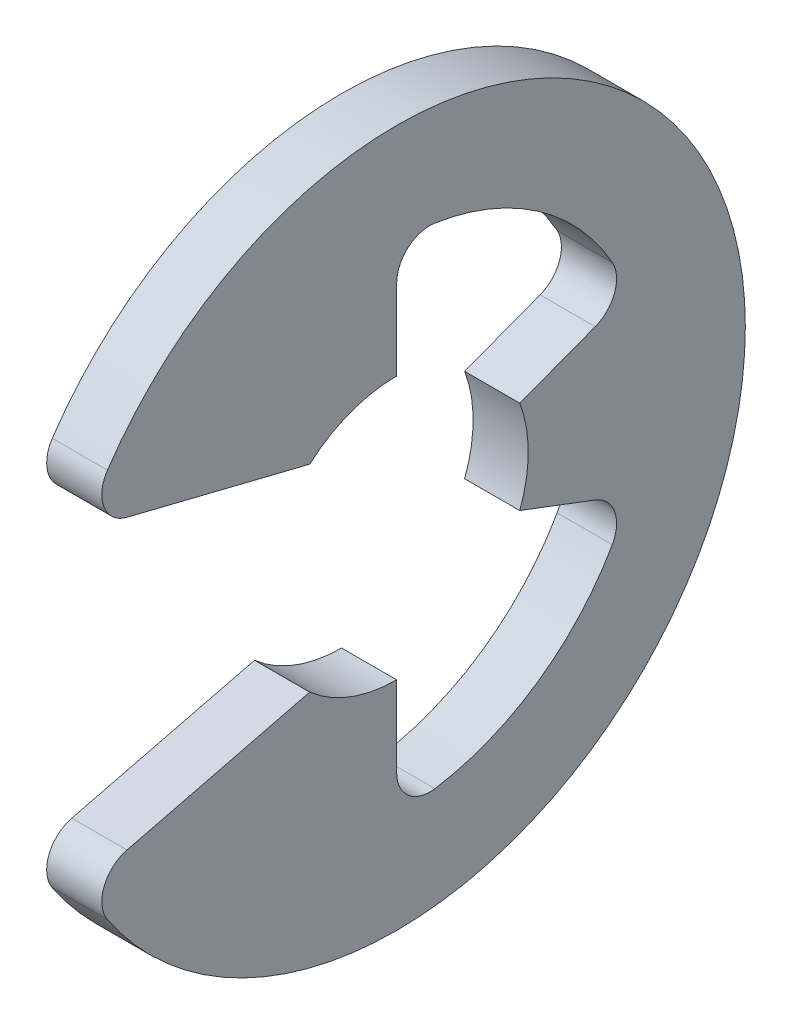
ISO-10303-21;
HEADER;
FILE_DESCRIPTION(('STEP AP214'),'2;1');
FILE_NAME('part.step','',(''),(''),'','','');
FILE_SCHEMA(('AUTOMOTIVE_DESIGN { 1 0 10303 214 1 1 1 1 }'));
ENDSEC;
DATA;
#1=APPLICATION_CONTEXT('core data for automotive mechanical design processes');
#2=APPLICATION_PROTOCOL_DEFINITION('international standard','automotive_design',2000,#1);
#3=PRODUCT_CONTEXT('',#1,'mechanical');
#4=PRODUCT('Part','Part','',(#3));
#5=PRODUCT_RELATED_PRODUCT_CATEGORY('part','',(#4));
#6=PRODUCT_DEFINITION_FORMATION('','',#4);
#7=PRODUCT_DEFINITION_CONTEXT('part definition',#1,'design');
#8=PRODUCT_DEFINITION('design','',#6,#7);
#9=PRODUCT_DEFINITION_SHAPE('','',#8);
#10=(LENGTH_UNIT() NAMED_UNIT(*) SI_UNIT(.MILLI.,.METRE.));
#11=(NAMED_UNIT(*) PLANE_ANGLE_UNIT() SI_UNIT($,.RADIAN.));
#12=(NAMED_UNIT(*) SI_UNIT($,.STERADIAN.) SOLID_ANGLE_UNIT());
#13=UNCERTAINTY_MEASURE_WITH_UNIT(LENGTH_MEASURE(1.E-05),#10,'distance_accuracy_value','');
#14=(GEOMETRIC_REPRESENTATION_CONTEXT(3) GLOBAL_UNCERTAINTY_ASSIGNED_CONTEXT((#13)) GLOBAL_UNIT_ASSIGNED_CONTEXT((#10,
#11,#12)) REPRESENTATION_CONTEXT('',''));
#15=CARTESIAN_POINT('',(0.,0.,0.));
#16=DIRECTION('',(0.,0.,1.));
#17=DIRECTION('',(1.,0.,0.));
#18=AXIS2_PLACEMENT_3D('',#15,#16,#17);
#19=CARTESIAN_POINT('',(-0.35,0.,0.));
#20=DIRECTION('',(1.,0.,0.));
#21=DIRECTION('',(0.,0.,-1.));
#22=AXIS2_PLACEMENT_3D('',#19,#20,#21);
#23=CYLINDRICAL_SURFACE('',#22,1.67);
#24=CARTESIAN_POINT('',(0.35,0.,0.));
#25=DIRECTION('',(-1.,0.,0.));
#26=DIRECTION('',(0.,0.,1.));
#27=AXIS2_PLACEMENT_3D('',#24,#25,#26);
#28=CIRCLE('',#27,1.67);
#29=CARTESIAN_POINT('',(0.35,-1.67,0.));
#30=VERTEX_POINT('',#29);
#31=CARTESIAN_POINT('',(0.35,-1.2525,1.10460117236947));
#32=VERTEX_POINT('',#31);
#33=EDGE_CURVE('E190',#30,#32,#28,.T.);
#34=ORIENTED_EDGE('',*,*,#33,.F.);
#35=DIRECTION('',(1.,0.,0.));
#36=VECTOR('',#35,1.);
#37=CARTESIAN_POINT('',(-0.35,-1.67,0.));
#38=LINE('',#37,#36);
#39=CARTESIAN_POINT('',(-0.35,-1.67,0.));
#40=VERTEX_POINT('',#39);
#41=EDGE_CURVE('E11',#40,#30,#38,.T.);
#42=ORIENTED_EDGE('',*,*,#41,.F.);
#43=CARTESIAN_POINT('',(-0.35,0.,0.));
#44=DIRECTION('',(-1.,0.,0.));
#45=DIRECTION('',(0.,0.,1.));
#46=AXIS2_PLACEMENT_3D('',#43,#44,#45);
#47=CIRCLE('',#46,1.67);
#48=CARTESIAN_POINT('',(-0.35,-1.2525,1.10460117236947));
#49=VERTEX_POINT('',#48);
#50=EDGE_CURVE('E240',#40,#49,#47,.T.);
#51=ORIENTED_EDGE('',*,*,#50,.T.);
#52=DIRECTION('',(1.,0.,0.));
#53=VECTOR('',#52,1.);
#54=CARTESIAN_POINT('',(-0.35,-1.2525,1.10460117236947));
#55=LINE('',#54,#53);
#56=EDGE_CURVE('E36',#49,#32,#55,.T.);
#57=ORIENTED_EDGE('',*,*,#56,.T.);
#58=EDGE_LOOP('',(#34,#42,#51,#57));
#59=FACE_BOUND('',#58,.T.);
#60=ADVANCED_FACE('F33',(#59),#23,.F.);
#61=CARTESIAN_POINT('',(-0.35,-2.693254687494,0.));
#62=DIRECTION('',(0.,0.,-1.));
#63=DIRECTION('',(0.,1.,0.));
#64=AXIS2_PLACEMENT_3D('',#61,#62,#63);
#65=PLANE('',#64);
#66=DIRECTION('',(0.,1.,0.));
#67=VECTOR('',#66,1.);
#68=CARTESIAN_POINT('',(0.35,-2.693254687494,0.));
#69=LINE('',#68,#67);
#70=CARTESIAN_POINT('',(0.35,-2.693254687494,0.));
#71=VERTEX_POINT('',#70);
#72=EDGE_CURVE('E238',#71,#30,#69,.T.);
#73=ORIENTED_EDGE('',*,*,#72,.F.);
#74=DIRECTION('',(1.,0.,0.));
#75=VECTOR('',#74,1.);
#76=CARTESIAN_POINT('',(-0.35,-2.693254687494,0.));
#77=LINE('',#76,#75);
#78=CARTESIAN_POINT('',(-0.35,-2.693254687494,0.));
#79=VERTEX_POINT('',#78);
#80=EDGE_CURVE('E42',#79,#71,#77,.T.);
#81=ORIENTED_EDGE('',*,*,#80,.F.);
#82=DIRECTION('',(0.,1.,0.));
#83=VECTOR('',#82,1.);
#84=CARTESIAN_POINT('',(-0.35,-2.693254687494,0.));
#85=LINE('',#84,#83);
#86=EDGE_CURVE('E180',#79,#40,#85,.T.);
#87=ORIENTED_EDGE('',*,*,#86,.T.);
#88=ORIENTED_EDGE('',*,*,#41,.T.);
#89=EDGE_LOOP('',(#73,#81,#87,#88));
#90=FACE_BOUND('',#89,.T.);
#91=ADVANCED_FACE('F272',(#90),#65,.T.);
#92=CARTESIAN_POINT('',(-0.35,-2.693254687494,-0.419999999999289));
#93=DIRECTION('',(1.,0.,0.));
#94=DIRECTION('',(0.,0.,-1.));
#95=AXIS2_PLACEMENT_3D('',#92,#93,#94);
#96=CYLINDRICAL_SURFACE('',#95,0.41999999999929);
#97=CARTESIAN_POINT('',(0.35,-2.693254687494,-0.419999999999289));
#98=DIRECTION('',(-1.,0.,0.));
#99=DIRECTION('',(0.,0.,1.));
#100=AXIS2_PLACEMENT_3D('',#97,#98,#99);
#101=CIRCLE('',#100,0.41999999999929);
#102=CARTESIAN_POINT('',(0.35,-3.10823901922165,-0.484714792898247));
#103=VERTEX_POINT('',#102);
#104=EDGE_CURVE('E167',#103,#71,#101,.T.);
#105=ORIENTED_EDGE('',*,*,#104,.F.);
#106=DIRECTION('',(1.,0.,0.));
#107=VECTOR('',#106,1.);
#108=CARTESIAN_POINT('',(-0.35,-3.10823901922165,-0.484714792898247));
#109=LINE('',#108,#107);
#110=CARTESIAN_POINT('',(-0.35,-3.10823901922165,-0.484714792898247));
#111=VERTEX_POINT('',#110);
#112=EDGE_CURVE('E162',#111,#103,#109,.T.);
#113=ORIENTED_EDGE('',*,*,#112,.F.);
#114=CARTESIAN_POINT('',(-0.35,-2.693254687494,-0.419999999999289));
#115=DIRECTION('',(-1.,0.,0.));
#116=DIRECTION('',(0.,0.,1.));
#117=AXIS2_PLACEMENT_3D('',#114,#115,#116);
#118=CIRCLE('',#117,0.41999999999929);
#119=EDGE_CURVE('E165',#111,#79,#118,.T.);
#120=ORIENTED_EDGE('',*,*,#119,.T.);
#121=ORIENTED_EDGE('',*,*,#80,.T.);
#122=EDGE_LOOP('',(#105,#113,#120,#121));
#123=FACE_BOUND('',#122,.T.);
#124=ADVANCED_FACE('F164',(#123),#96,.F.);
#125=CARTESIAN_POINT('',(-0.35,0.,0.));
#126=DIRECTION('',(1.,0.,0.));
#127=DIRECTION('',(0.,0.,-1.));
#128=AXIS2_PLACEMENT_3D('',#125,#126,#127);
#129=CYLINDRICAL_SURFACE('',#128,3.14580645162197);
#130=CARTESIAN_POINT('',(0.35,0.,0.));
#131=DIRECTION('',(-1.,0.,0.));
#132=DIRECTION('',(0.,0.,1.));
#133=AXIS2_PLACEMENT_3D('',#130,#131,#132);
#134=CIRCLE('',#133,3.14580645162197);
#135=CARTESIAN_POINT('',(0.35,-1.55233761535774,-2.73611881302911));
#136=VERTEX_POINT('',#135);
#137=EDGE_CURVE('E235',#136,#103,#134,.T.);
#138=ORIENTED_EDGE('',*,*,#137,.F.);
#139=DIRECTION('',(1.,0.,0.));
#140=VECTOR('',#139,1.);
#141=CARTESIAN_POINT('',(-0.35,-1.55233761535774,-2.73611881302911));
#142=LINE('',#141,#140);
#143=CARTESIAN_POINT('',(-0.35,-1.55233761535774,-2.73611881302911));
#144=VERTEX_POINT('',#143);
#145=EDGE_CURVE('E172',#144,#136,#142,.T.);
#146=ORIENTED_EDGE('',*,*,#145,.F.);
#147=CARTESIAN_POINT('',(-0.35,0.,0.));
#148=DIRECTION('',(-1.,0.,0.));
#149=DIRECTION('',(0.,0.,1.));
#150=AXIS2_PLACEMENT_3D('',#147,#148,#149);
#151=CIRCLE('',#150,3.14580645162197);
#152=EDGE_CURVE('E178',#144,#111,#151,.T.);
#153=ORIENTED_EDGE('',*,*,#152,.T.);
#154=ORIENTED_EDGE('',*,*,#112,.T.);
#155=EDGE_LOOP('',(#138,#146,#153,#154));
#156=FACE_BOUND('',#155,.T.);
#157=ADVANCED_FACE('F182',(#156),#129,.F.);
#158=CARTESIAN_POINT('',(-0.35,-1.34508335211213,-2.37081664993226));
#159=DIRECTION('',(1.,0.,0.));
#160=DIRECTION('',(0.,0.,-1.));
#161=AXIS2_PLACEMENT_3D('',#158,#159,#160);
#162=CYLINDRICAL_SURFACE('',#161,0.419999999996093);
#163=CARTESIAN_POINT('',(0.35,-1.34508335211213,-2.37081664993226));
#164=DIRECTION('',(-1.,0.,0.));
#165=DIRECTION('',(0.,0.,1.));
#166=AXIS2_PLACEMENT_3D('',#163,#164,#165);
#167=CIRCLE('',#166,0.419999999996093);
#168=CARTESIAN_POINT('',(0.35,-0.952209326505052,-2.51930907398146));
#169=VERTEX_POINT('',#168);
#170=EDGE_CURVE('E232',#169,#136,#167,.T.);
#171=ORIENTED_EDGE('',*,*,#170,.F.);
#172=DIRECTION('',(1.,0.,0.));
#173=VECTOR('',#172,1.);
#174=CARTESIAN_POINT('',(-0.35,-0.952209326505052,-2.51930907398146));
#175=LINE('',#174,#173);
#176=CARTESIAN_POINT('',(-0.35,-0.952209326505052,-2.51930907398146));
#177=VERTEX_POINT('',#176);
#178=EDGE_CURVE('E244',#177,#169,#175,.T.);
#179=ORIENTED_EDGE('',*,*,#178,.F.);
#180=CARTESIAN_POINT('',(-0.35,-1.34508335211213,-2.37081664993226));
#181=DIRECTION('',(-1.,0.,0.));
#182=DIRECTION('',(0.,0.,1.));
#183=AXIS2_PLACEMENT_3D('',#180,#181,#182);
#184=CIRCLE('',#183,0.419999999996093);
#185=EDGE_CURVE('E183',#177,#144,#184,.T.);
#186=ORIENTED_EDGE('',*,*,#185,.T.);
#187=ORIENTED_EDGE('',*,*,#145,.T.);
#188=EDGE_LOOP('',(#171,#179,#186,#187));
#189=FACE_BOUND('',#188,.T.);
#190=ADVANCED_FACE('F285',(#189),#162,.F.);
#191=CARTESIAN_POINT('',(-0.35,-0.590434162296348,-1.56214195897601));
#192=DIRECTION('',(0.,-0.935414346692222,0.353553390596615));
#193=DIRECTION('',(0.,-0.353553390596615,-0.935414346692222));
#194=AXIS2_PLACEMENT_3D('',#191,#192,#193);
#195=PLANE('',#194);
#196=DIRECTION('',(0.,-0.353553390596615,-0.935414346692222));
#197=VECTOR('',#196,1.);
#198=CARTESIAN_POINT('',(0.35,-0.590434162296348,-1.56214195897601));
#199=LINE('',#198,#197);
#200=CARTESIAN_POINT('',(0.35,-0.590434162296348,-1.56214195897601));
#201=VERTEX_POINT('',#200);
#202=EDGE_CURVE('E229',#201,#169,#199,.T.);
#203=ORIENTED_EDGE('',*,*,#202,.F.);
#204=DIRECTION('',(1.,0.,0.));
#205=VECTOR('',#204,1.);
#206=CARTESIAN_POINT('',(-0.35,-0.590434162296348,-1.56214195897601));
#207=LINE('',#206,#205);
#208=CARTESIAN_POINT('',(-0.35,-0.590434162296348,-1.56214195897601));
#209=VERTEX_POINT('',#208);
#210=EDGE_CURVE('E246',#209,#201,#207,.T.);
#211=ORIENTED_EDGE('',*,*,#210,.F.);
#212=DIRECTION('',(0.,-0.353553390596615,-0.935414346692222));
#213=VECTOR('',#212,1.);
#214=CARTESIAN_POINT('',(-0.35,-0.590434162296348,-1.56214195897601));
#215=LINE('',#214,#213);
#216=EDGE_CURVE('E185',#209,#177,#215,.T.);
#217=ORIENTED_EDGE('',*,*,#216,.T.);
#218=ORIENTED_EDGE('',*,*,#178,.T.);
#219=EDGE_LOOP('',(#203,#211,#217,#218));
#220=FACE_BOUND('',#219,.T.);
#221=ADVANCED_FACE('F288',(#220),#195,.T.);
#222=CARTESIAN_POINT('',(-0.35,0.,0.));
#223=DIRECTION('',(1.,0.,0.));
#224=DIRECTION('',(0.,0.,-1.));
#225=AXIS2_PLACEMENT_3D('',#222,#223,#224);
#226=CYLINDRICAL_SURFACE('',#225,1.67);
#227=CARTESIAN_POINT('',(0.35,0.,0.));
#228=DIRECTION('',(-1.,0.,0.));
#229=DIRECTION('',(0.,0.,1.));
#230=AXIS2_PLACEMENT_3D('',#227,#228,#229);
#231=CIRCLE('',#230,1.67);
#232=CARTESIAN_POINT('',(0.35,0.590434162296348,-1.56214195897601));
#233=VERTEX_POINT('',#232);
#234=EDGE_CURVE('E226',#233,#201,#231,.T.);
#235=ORIENTED_EDGE('',*,*,#234,.F.);
#236=DIRECTION('',(1.,0.,0.));
#237=VECTOR('',#236,1.);
#238=CARTESIAN_POINT('',(-0.35,0.590434162296348,-1.56214195897601));
#239=LINE('',#238,#237);
#240=CARTESIAN_POINT('',(-0.35,0.590434162296348,-1.56214195897601));
#241=VERTEX_POINT('',#240);
#242=EDGE_CURVE('E248',#241,#233,#239,.T.);
#243=ORIENTED_EDGE('',*,*,#242,.F.);
#244=CARTESIAN_POINT('',(-0.35,0.,0.));
#245=DIRECTION('',(-1.,0.,0.));
#246=DIRECTION('',(0.,0.,1.));
#247=AXIS2_PLACEMENT_3D('',#244,#245,#246);
#248=CIRCLE('',#247,1.67);
#249=EDGE_CURVE('E496',#241,#209,#248,.T.);
#250=ORIENTED_EDGE('',*,*,#249,.T.);
#251=ORIENTED_EDGE('',*,*,#210,.T.);
#252=EDGE_LOOP('',(#235,#243,#250,#251));
#253=FACE_BOUND('',#252,.T.);
#254=ADVANCED_FACE('F292',(#253),#226,.F.);
#255=CARTESIAN_POINT('',(-0.35,0.952209326505051,-2.51930907398145));
#256=DIRECTION('',(0.,0.935414346692222,0.353553390596616));
#257=DIRECTION('',(0.,-0.353553390596616,0.935414346692222));
#258=AXIS2_PLACEMENT_3D('',#255,#256,#257);
#259=PLANE('',#258);
#260=DIRECTION('',(0.,-0.353553390596616,0.935414346692222));
#261=VECTOR('',#260,1.);
#262=CARTESIAN_POINT('',(0.35,0.952209326505051,-2.51930907398145));
#263=LINE('',#262,#261);
#264=CARTESIAN_POINT('',(0.35,0.952209326505051,-2.51930907398145));
#265=VERTEX_POINT('',#264);
#266=EDGE_CURVE('E223',#265,#233,#263,.T.);
#267=ORIENTED_EDGE('',*,*,#266,.F.);
#268=DIRECTION('',(1.,0.,0.));
#269=VECTOR('',#268,1.);
#270=CARTESIAN_POINT('',(-0.35,0.952209326505051,-2.51930907398145));
#271=LINE('',#270,#269);
#272=CARTESIAN_POINT('',(-0.35,0.952209326505051,-2.51930907398145));
#273=VERTEX_POINT('',#272);
#274=EDGE_CURVE('E250',#273,#265,#271,.T.);
#275=ORIENTED_EDGE('',*,*,#274,.F.);
#276=DIRECTION('',(0.,-0.353553390596616,0.935414346692222));
#277=VECTOR('',#276,1.);
#278=CARTESIAN_POINT('',(-0.35,0.952209326505051,-2.51930907398145));
#279=LINE('',#278,#277);
#280=EDGE_CURVE('E500',#273,#241,#279,.T.);
#281=ORIENTED_EDGE('',*,*,#280,.T.);
#282=ORIENTED_EDGE('',*,*,#242,.T.);
#283=EDGE_LOOP('',(#267,#275,#281,#282));
#284=FACE_BOUND('',#283,.T.);
#285=ADVANCED_FACE('F296',(#284),#259,.T.);
#286=CARTESIAN_POINT('',(-0.35,1.34508335211213,-2.37081664993226));
#287=DIRECTION('',(1.,0.,0.));
#288=DIRECTION('',(0.,0.,-1.));
#289=AXIS2_PLACEMENT_3D('',#286,#287,#288);
#290=CYLINDRICAL_SURFACE('',#289,0.419999999996095);
#291=CARTESIAN_POINT('',(0.35,1.34508335211213,-2.37081664993226));
#292=DIRECTION('',(-1.,0.,0.));
#293=DIRECTION('',(0.,0.,1.));
#294=AXIS2_PLACEMENT_3D('',#291,#292,#293);
#295=CIRCLE('',#294,0.419999999996095);
#296=CARTESIAN_POINT('',(0.35,1.55233761535774,-2.73611881302911));
#297=VERTEX_POINT('',#296);
#298=EDGE_CURVE('E220',#297,#265,#295,.T.);
#299=ORIENTED_EDGE('',*,*,#298,.F.);
#300=DIRECTION('',(1.,0.,0.));
#301=VECTOR('',#300,1.);
#302=CARTESIAN_POINT('',(-0.35,1.55233761535774,-2.73611881302911));
#303=LINE('',#302,#301);
#304=CARTESIAN_POINT('',(-0.35,1.55233761535774,-2.73611881302911));
#305=VERTEX_POINT('',#304);
#306=EDGE_CURVE('E252',#305,#297,#303,.T.);
#307=ORIENTED_EDGE('',*,*,#306,.F.);
#308=CARTESIAN_POINT('',(-0.35,1.34508335211213,-2.37081664993226));
#309=DIRECTION('',(-1.,0.,0.));
#310=DIRECTION('',(0.,0.,1.));
#311=AXIS2_PLACEMENT_3D('',#308,#309,#310);
#312=CIRCLE('',#311,0.419999999996095);
#313=EDGE_CURVE('E489',#305,#273,#312,.T.);
#314=ORIENTED_EDGE('',*,*,#313,.T.);
#315=ORIENTED_EDGE('',*,*,#274,.T.);
#316=EDGE_LOOP('',(#299,#307,#314,#315));
#317=FACE_BOUND('',#316,.T.);
#318=ADVANCED_FACE('F300',(#317),#290,.F.);
#319=CARTESIAN_POINT('',(-0.35,0.,0.));
#320=DIRECTION('',(1.,0.,0.));
#321=DIRECTION('',(0.,0.,-1.));
#322=AXIS2_PLACEMENT_3D('',#319,#320,#321);
#323=CYLINDRICAL_SURFACE('',#322,3.14580645162197);
#324=CARTESIAN_POINT('',(0.35,0.,0.));
#325=DIRECTION('',(-1.,0.,0.));
#326=DIRECTION('',(0.,0.,1.));
#327=AXIS2_PLACEMENT_3D('',#324,#325,#326);
#328=CIRCLE('',#327,3.14580645162197);
#329=CARTESIAN_POINT('',(0.35,3.10823901922166,-0.484714792898246));
#330=VERTEX_POINT('',#329);
#331=EDGE_CURVE('E217',#330,#297,#328,.T.);
#332=ORIENTED_EDGE('',*,*,#331,.F.);
#333=DIRECTION('',(1.,0.,0.));
#334=VECTOR('',#333,1.);
#335=CARTESIAN_POINT('',(-0.35,3.10823901922166,-0.484714792898246));
#336=LINE('',#335,#334);
#337=CARTESIAN_POINT('',(-0.35,3.10823901922166,-0.484714792898246));
#338=VERTEX_POINT('',#337);
#339=EDGE_CURVE('E254',#338,#330,#336,.T.);
#340=ORIENTED_EDGE('',*,*,#339,.F.);
#341=CARTESIAN_POINT('',(-0.35,0.,0.));
#342=DIRECTION('',(-1.,0.,0.));
#343=DIRECTION('',(0.,0.,1.));
#344=AXIS2_PLACEMENT_3D('',#341,#342,#343);
#345=CIRCLE('',#344,3.14580645162197);
#346=EDGE_CURVE('E485',#338,#305,#345,.T.);
#347=ORIENTED_EDGE('',*,*,#346,.T.);
#348=ORIENTED_EDGE('',*,*,#306,.T.);
#349=EDGE_LOOP('',(#332,#340,#347,#348));
#350=FACE_BOUND('',#349,.T.);
#351=ADVANCED_FACE('F304',(#350),#323,.F.);
#352=CARTESIAN_POINT('',(-0.35,2.693254687494,-0.419999999999289));
#353=DIRECTION('',(1.,0.,0.));
#354=DIRECTION('',(0.,0.,-1.));
#355=AXIS2_PLACEMENT_3D('',#352,#353,#354);
#356=CYLINDRICAL_SURFACE('',#355,0.41999999999929);
#357=CARTESIAN_POINT('',(0.35,2.693254687494,-0.419999999999289));
#358=DIRECTION('',(-1.,0.,0.));
#359=DIRECTION('',(0.,0.,1.));
#360=AXIS2_PLACEMENT_3D('',#357,#358,#359);
#361=CIRCLE('',#360,0.41999999999929);
#362=CARTESIAN_POINT('',(0.35,2.693254687494,0.));
#363=VERTEX_POINT('',#362);
#364=EDGE_CURVE('E214',#363,#330,#361,.T.);
#365=ORIENTED_EDGE('',*,*,#364,.F.);
#366=DIRECTION('',(1.,0.,0.));
#367=VECTOR('',#366,1.);
#368=CARTESIAN_POINT('',(-0.35,2.693254687494,0.));
#369=LINE('',#368,#367);
#370=CARTESIAN_POINT('',(-0.35,2.693254687494,0.));
#371=VERTEX_POINT('',#370);
#372=EDGE_CURVE('E256',#371,#363,#369,.T.);
#373=ORIENTED_EDGE('',*,*,#372,.F.);
#374=CARTESIAN_POINT('',(-0.35,2.693254687494,-0.419999999999289));
#375=DIRECTION('',(-1.,0.,0.));
#376=DIRECTION('',(0.,0.,1.));
#377=AXIS2_PLACEMENT_3D('',#374,#375,#376);
#378=CIRCLE('',#377,0.41999999999929);
#379=EDGE_CURVE('E506',#371,#338,#378,.T.);
#380=ORIENTED_EDGE('',*,*,#379,.T.);
#381=ORIENTED_EDGE('',*,*,#339,.T.);
#382=EDGE_LOOP('',(#365,#373,#380,#381));
#383=FACE_BOUND('',#382,.T.);
#384=ADVANCED_FACE('F308',(#383),#356,.F.);
#385=CARTESIAN_POINT('',(-0.35,1.67,0.));
#386=DIRECTION('',(0.,0.,-1.));
#387=DIRECTION('',(0.,1.,0.));
#388=AXIS2_PLACEMENT_3D('',#385,#386,#387);
#389=PLANE('',#388);
#390=DIRECTION('',(0.,1.,0.));
#391=VECTOR('',#390,1.);
#392=CARTESIAN_POINT('',(0.35,1.67,0.));
#393=LINE('',#392,#391);
#394=CARTESIAN_POINT('',(0.35,1.67,0.));
#395=VERTEX_POINT('',#394);
#396=EDGE_CURVE('E211',#395,#363,#393,.T.);
#397=ORIENTED_EDGE('',*,*,#396,.F.);
#398=DIRECTION('',(1.,0.,0.));
#399=VECTOR('',#398,1.);
#400=CARTESIAN_POINT('',(-0.35,1.67,0.));
#401=LINE('',#400,#399);
#402=CARTESIAN_POINT('',(-0.35,1.67,0.));
#403=VERTEX_POINT('',#402);
#404=EDGE_CURVE('E258',#403,#395,#401,.T.);
#405=ORIENTED_EDGE('',*,*,#404,.F.);
#406=DIRECTION('',(0.,1.,0.));
#407=VECTOR('',#406,1.);
#408=CARTESIAN_POINT('',(-0.35,1.67,0.));
#409=LINE('',#408,#407);
#410=EDGE_CURVE('E478',#403,#371,#409,.T.);
#411=ORIENTED_EDGE('',*,*,#410,.T.);
#412=ORIENTED_EDGE('',*,*,#372,.T.);
#413=EDGE_LOOP('',(#397,#405,#411,#412));
#414=FACE_BOUND('',#413,.T.);
#415=ADVANCED_FACE('F312',(#414),#389,.T.);
#416=CARTESIAN_POINT('',(-0.35,0.,0.));
#417=DIRECTION('',(1.,0.,0.));
#418=DIRECTION('',(0.,0.,-1.));
#419=AXIS2_PLACEMENT_3D('',#416,#417,#418);
#420=CYLINDRICAL_SURFACE('',#419,1.67);
#421=CARTESIAN_POINT('',(0.35,0.,0.));
#422=DIRECTION('',(-1.,0.,0.));
#423=DIRECTION('',(0.,0.,1.));
#424=AXIS2_PLACEMENT_3D('',#421,#422,#423);
#425=CIRCLE('',#424,1.67);
#426=CARTESIAN_POINT('',(0.35,1.2525,1.10460117236947));
#427=VERTEX_POINT('',#426);
#428=EDGE_CURVE('E208',#427,#395,#425,.T.);
#429=ORIENTED_EDGE('',*,*,#428,.F.);
#430=DIRECTION('',(1.,0.,0.));
#431=VECTOR('',#430,1.);
#432=CARTESIAN_POINT('',(-0.35,1.2525,1.10460117236947));
#433=LINE('',#432,#431);
#434=CARTESIAN_POINT('',(-0.35,1.2525,1.10460117236947));
#435=VERTEX_POINT('',#434);
#436=EDGE_CURVE('E260',#435,#427,#433,.T.);
#437=ORIENTED_EDGE('',*,*,#436,.F.);
#438=CARTESIAN_POINT('',(-0.35,0.,0.));
#439=DIRECTION('',(-1.,0.,0.));
#440=DIRECTION('',(0.,0.,1.));
#441=AXIS2_PLACEMENT_3D('',#438,#439,#440);
#442=CIRCLE('',#441,1.67);
#443=EDGE_CURVE('E474',#435,#403,#442,.T.);
#444=ORIENTED_EDGE('',*,*,#443,.T.);
#445=ORIENTED_EDGE('',*,*,#404,.T.);
#446=EDGE_LOOP('',(#429,#437,#444,#445));
#447=FACE_BOUND('',#446,.T.);
#448=ADVANCED_FACE('F316',(#447),#420,.F.);
#449=CARTESIAN_POINT('',(-0.35,1.82831623494549,3.42393846784504));
#450=DIRECTION('',(0.,-0.970536829925373,0.240952820606874));
#451=DIRECTION('',(0.,-0.240952820606874,-0.970536829925373));
#452=AXIS2_PLACEMENT_3D('',#449,#450,#451);
#453=PLANE('',#452);
#454=DIRECTION('',(0.,-0.240952820606874,-0.970536829925373));
#455=VECTOR('',#454,1.);
#456=CARTESIAN_POINT('',(0.35,1.82831623494549,3.42393846784504));
#457=LINE('',#456,#455);
#458=CARTESIAN_POINT('',(0.35,1.82831623494549,3.42393846784504));
#459=VERTEX_POINT('',#458);
#460=EDGE_CURVE('E205',#459,#427,#457,.T.);
#461=ORIENTED_EDGE('',*,*,#460,.F.);
#462=DIRECTION('',(1.,0.,0.));
#463=VECTOR('',#462,1.);
#464=CARTESIAN_POINT('',(-0.35,1.82831623494549,3.42393846784504));
#465=LINE('',#464,#463);
#466=CARTESIAN_POINT('',(-0.35,1.82831623494549,3.42393846784504));
#467=VERTEX_POINT('',#466);
#468=EDGE_CURVE('E262',#467,#459,#465,.T.);
#469=ORIENTED_EDGE('',*,*,#468,.F.);
#470=DIRECTION('',(0.,-0.240952820606874,-0.970536829925373));
#471=VECTOR('',#470,1.);
#472=CARTESIAN_POINT('',(-0.35,1.82831623494549,3.42393846784504));
#473=LINE('',#472,#471);
#474=EDGE_CURVE('E510',#467,#435,#473,.T.);
#475=ORIENTED_EDGE('',*,*,#474,.T.);
#476=ORIENTED_EDGE('',*,*,#436,.T.);
#477=EDGE_LOOP('',(#461,#469,#475,#476));
#478=FACE_BOUND('',#477,.T.);
#479=ADVANCED_FACE('F320',(#478),#453,.T.);
#480=CARTESIAN_POINT('',(-0.35,2.23594170351095,3.32273828319095));
#481=DIRECTION('',(1.,0.,0.));
#482=DIRECTION('',(0.,0.,-1.));
#483=AXIS2_PLACEMENT_3D('',#480,#481,#482);
#484=CYLINDRICAL_SURFACE('',#483,0.419999999996708);
#485=CARTESIAN_POINT('',(0.35,2.23594170351095,3.32273828319095));
#486=DIRECTION('',(1.,0.,0.));
#487=DIRECTION('',(0.,0.,-1.));
#488=AXIS2_PLACEMENT_3D('',#485,#486,#487);
#489=CIRCLE('',#488,0.419999999996708);
#490=CARTESIAN_POINT('',(0.35,2.47042248140479,3.67119023797889));
#491=VERTEX_POINT('',#490);
#492=EDGE_CURVE('E202',#491,#459,#489,.T.);
#493=ORIENTED_EDGE('',*,*,#492,.F.);
#494=DIRECTION('',(1.,0.,0.));
#495=VECTOR('',#494,1.);
#496=CARTESIAN_POINT('',(-0.35,2.47042248140479,3.67119023797889));
#497=LINE('',#496,#495);
#498=CARTESIAN_POINT('',(-0.35,2.47042248140479,3.67119023797889));
#499=VERTEX_POINT('',#498);
#500=EDGE_CURVE('E264',#499,#491,#497,.T.);
#501=ORIENTED_EDGE('',*,*,#500,.F.);
#502=CARTESIAN_POINT('',(-0.35,2.23594170351095,3.32273828319095));
#503=DIRECTION('',(1.,0.,0.));
#504=DIRECTION('',(0.,0.,-1.));
#505=AXIS2_PLACEMENT_3D('',#502,#503,#504);
#506=CIRCLE('',#505,0.419999999996708);
#507=EDGE_CURVE('E467',#499,#467,#506,.T.);
#508=ORIENTED_EDGE('',*,*,#507,.T.);
#509=ORIENTED_EDGE('',*,*,#468,.T.);
#510=EDGE_LOOP('',(#493,#501,#508,#509));
#511=FACE_BOUND('',#510,.T.);
#512=ADVANCED_FACE('F324',(#511),#484,.T.);
#513=CARTESIAN_POINT('',(-0.35,0.,0.));
#514=DIRECTION('',(1.,0.,0.));
#515=DIRECTION('',(0.,0.,-1.));
#516=AXIS2_PLACEMENT_3D('',#513,#514,#515);
#517=CYLINDRICAL_SURFACE('',#516,4.42500000000697);
#518=CARTESIAN_POINT('',(0.35,0.,0.));
#519=DIRECTION('',(1.,0.,0.));
#520=DIRECTION('',(0.,0.,-1.));
#521=AXIS2_PLACEMENT_3D('',#518,#519,#520);
#522=CIRCLE('',#521,4.42500000000697);
#523=CARTESIAN_POINT('',(0.35,-2.47042248141391,3.67119023797275));
#524=VERTEX_POINT('',#523);
#525=EDGE_CURVE('E199',#524,#491,#522,.T.);
#526=ORIENTED_EDGE('',*,*,#525,.F.);
#527=DIRECTION('',(1.,0.,0.));
#528=VECTOR('',#527,1.);
#529=CARTESIAN_POINT('',(-0.35,-2.47042248141391,3.67119023797275));
#530=LINE('',#529,#528);
#531=CARTESIAN_POINT('',(-0.35,-2.47042248141391,3.67119023797275));
#532=VERTEX_POINT('',#531);
#533=EDGE_CURVE('E266',#532,#524,#530,.T.);
#534=ORIENTED_EDGE('',*,*,#533,.F.);
#535=CARTESIAN_POINT('',(-0.35,0.,0.));
#536=DIRECTION('',(1.,0.,0.));
#537=DIRECTION('',(0.,0.,-1.));
#538=AXIS2_PLACEMENT_3D('',#535,#536,#537);
#539=CIRCLE('',#538,4.42500000000697);
#540=EDGE_CURVE('E463',#532,#499,#539,.T.);
#541=ORIENTED_EDGE('',*,*,#540,.T.);
#542=ORIENTED_EDGE('',*,*,#500,.T.);
#543=EDGE_LOOP('',(#526,#534,#541,#542));
#544=FACE_BOUND('',#543,.T.);
#545=ADVANCED_FACE('F328',(#544),#517,.T.);
#546=CARTESIAN_POINT('',(-0.35,-2.2359417035192,3.3227382831854));
#547=DIRECTION('',(1.,0.,0.));
#548=DIRECTION('',(0.,0.,-1.));
#549=AXIS2_PLACEMENT_3D('',#546,#547,#548);
#550=CYLINDRICAL_SURFACE('',#549,0.419999999996708);
#551=CARTESIAN_POINT('',(0.35,-2.2359417035192,3.3227382831854));
#552=DIRECTION('',(1.,0.,0.));
#553=DIRECTION('',(0.,0.,-1.));
#554=AXIS2_PLACEMENT_3D('',#551,#552,#553);
#555=CIRCLE('',#554,0.419999999996708);
#556=CARTESIAN_POINT('',(0.35,-1.82831623495414,3.42393846784109));
#557=VERTEX_POINT('',#556);
#558=EDGE_CURVE('E196',#557,#524,#555,.T.);
#559=ORIENTED_EDGE('',*,*,#558,.F.);
#560=DIRECTION('',(1.,0.,0.));
#561=VECTOR('',#560,1.);
#562=CARTESIAN_POINT('',(-0.35,-1.82831623495414,3.42393846784109));
#563=LINE('',#562,#561);
#564=CARTESIAN_POINT('',(-0.35,-1.82831623495414,3.42393846784109));
#565=VERTEX_POINT('',#564);
#566=EDGE_CURVE('E267',#565,#557,#563,.T.);
#567=ORIENTED_EDGE('',*,*,#566,.F.);
#568=CARTESIAN_POINT('',(-0.35,-2.2359417035192,3.3227382831854));
#569=DIRECTION('',(1.,0.,0.));
#570=DIRECTION('',(0.,0.,-1.));
#571=AXIS2_PLACEMENT_3D('',#568,#569,#570);
#572=CIRCLE('',#571,0.419999999996708);
#573=EDGE_CURVE('E514',#565,#532,#572,.T.);
#574=ORIENTED_EDGE('',*,*,#573,.T.);
#575=ORIENTED_EDGE('',*,*,#533,.T.);
#576=EDGE_LOOP('',(#559,#567,#574,#575));
#577=FACE_BOUND('',#576,.T.);
#578=ADVANCED_FACE('F332',(#577),#550,.T.);
#579=CARTESIAN_POINT('',(-0.35,-1.2525,1.10460117236947));
#580=DIRECTION('',(0.,0.97053682992443,0.240952820610671));
#581=DIRECTION('',(0.,-0.240952820610671,0.97053682992443));
#582=AXIS2_PLACEMENT_3D('',#579,#580,#581);
#583=PLANE('',#582);
#584=DIRECTION('',(0.,-0.240952820610671,0.97053682992443));
#585=VECTOR('',#584,1.);
#586=CARTESIAN_POINT('',(0.35,-1.2525,1.10460117236947));
#587=LINE('',#586,#585);
#588=EDGE_CURVE('E193',#32,#557,#587,.T.);
#589=ORIENTED_EDGE('',*,*,#588,.F.);
#590=ORIENTED_EDGE('',*,*,#56,.F.);
#591=DIRECTION('',(0.,-0.240952820610671,0.97053682992443));
#592=VECTOR('',#591,1.);
#593=CARTESIAN_POINT('',(-0.35,-1.2525,1.10460117236947));
#594=LINE('',#593,#592);
#595=EDGE_CURVE('E516',#49,#565,#594,.T.);
#596=ORIENTED_EDGE('',*,*,#595,.T.);
#597=ORIENTED_EDGE('',*,*,#566,.T.);
#598=EDGE_LOOP('',(#589,#590,#596,#597));
#599=FACE_BOUND('',#598,.T.);
#600=ADVANCED_FACE('F269',(#599),#583,.T.);
#601=CARTESIAN_POINT('',(-0.35,0.,0.));
#602=DIRECTION('',(-1.,0.,0.));
#603=DIRECTION('',(0.,0.,1.));
#604=AXIS2_PLACEMENT_3D('',#601,#602,#603);
#605=PLANE('',#604);
#606=ORIENTED_EDGE('',*,*,#50,.F.);
#607=ORIENTED_EDGE('',*,*,#86,.F.);
#608=ORIENTED_EDGE('',*,*,#119,.F.);
#609=ORIENTED_EDGE('',*,*,#152,.F.);
#610=ORIENTED_EDGE('',*,*,#185,.F.);
#611=ORIENTED_EDGE('',*,*,#216,.F.);
#612=ORIENTED_EDGE('',*,*,#249,.F.);
#613=ORIENTED_EDGE('',*,*,#280,.F.);
#614=ORIENTED_EDGE('',*,*,#313,.F.);
#615=ORIENTED_EDGE('',*,*,#346,.F.);
#616=ORIENTED_EDGE('',*,*,#379,.F.);
#617=ORIENTED_EDGE('',*,*,#410,.F.);
#618=ORIENTED_EDGE('',*,*,#443,.F.);
#619=ORIENTED_EDGE('',*,*,#474,.F.);
#620=ORIENTED_EDGE('',*,*,#507,.F.);
#621=ORIENTED_EDGE('',*,*,#540,.F.);
#622=ORIENTED_EDGE('',*,*,#573,.F.);
#623=ORIENTED_EDGE('',*,*,#595,.F.);
#624=EDGE_LOOP('',(#606,#607,#608,#609,#610,#611,#612,#613,#614,#615,#616,#617,#618,#619,#620,
#621,#622,#623));
#625=FACE_BOUND('',#624,.T.);
#626=ADVANCED_FACE('F176',(#625),#605,.T.);
#627=CARTESIAN_POINT('',(0.35,0.,0.));
#628=DIRECTION('',(-1.,0.,0.));
#629=DIRECTION('',(0.,0.,1.));
#630=AXIS2_PLACEMENT_3D('',#627,#628,#629);
#631=PLANE('',#630);
#632=ORIENTED_EDGE('',*,*,#33,.T.);
#633=ORIENTED_EDGE('',*,*,#588,.T.);
#634=ORIENTED_EDGE('',*,*,#558,.T.);
#635=ORIENTED_EDGE('',*,*,#525,.T.);
#636=ORIENTED_EDGE('',*,*,#492,.T.);
#637=ORIENTED_EDGE('',*,*,#460,.T.);
#638=ORIENTED_EDGE('',*,*,#428,.T.);
#639=ORIENTED_EDGE('',*,*,#396,.T.);
#640=ORIENTED_EDGE('',*,*,#364,.T.);
#641=ORIENTED_EDGE('',*,*,#331,.T.);
#642=ORIENTED_EDGE('',*,*,#298,.T.);
#643=ORIENTED_EDGE('',*,*,#266,.T.);
#644=ORIENTED_EDGE('',*,*,#234,.T.);
#645=ORIENTED_EDGE('',*,*,#202,.T.);
#646=ORIENTED_EDGE('',*,*,#170,.T.);
#647=ORIENTED_EDGE('',*,*,#137,.T.);
#648=ORIENTED_EDGE('',*,*,#104,.T.);
#649=ORIENTED_EDGE('',*,*,#72,.T.);
#650=EDGE_LOOP('',(#632,#633,#634,#635,#636,#637,#638,#639,#640,#641,#642,#643,#644,#645,#646,
#647,#648,#649));
#651=FACE_BOUND('',#650,.T.);
#652=ADVANCED_FACE('F271',(#651),#631,.F.);
#653=CLOSED_SHELL('',(#60,#91,#124,#157,#190,#221,#254,#285,#318,#351,#384,#415,#448,#479,#512,
#545,#578,#600,#626,#652));
#654=MANIFOLD_SOLID_BREP('B2',#653);
#655=ADVANCED_BREP_SHAPE_REPRESENTATION('',(#18,#654),#14);
#656=SHAPE_DEFINITION_REPRESENTATION(#9,#655);
ENDSEC;
END-ISO-10303-21;
